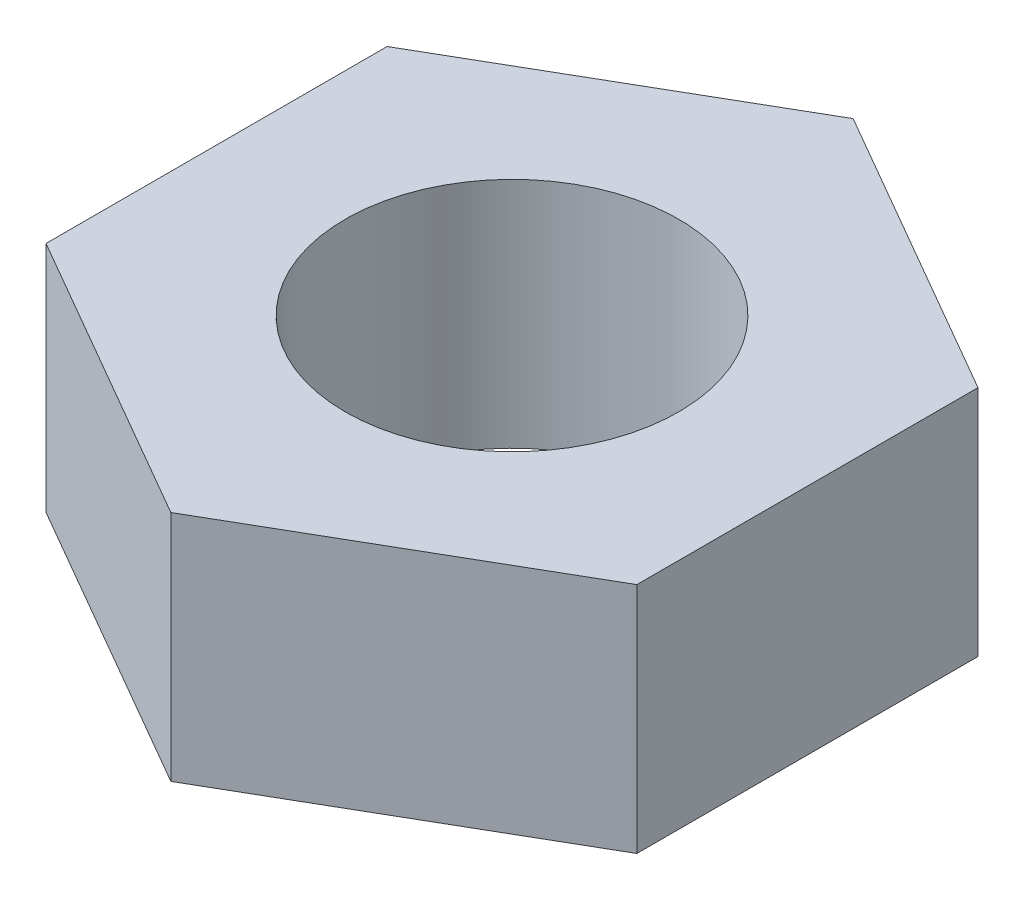
ISO-10303-21;
HEADER;
FILE_DESCRIPTION(('STEP AP214'),'2;1');
FILE_NAME('part.step','',(''),(''),'','','');
FILE_SCHEMA(('AUTOMOTIVE_DESIGN { 1 0 10303 214 1 1 1 1 }'));
ENDSEC;
DATA;
#1=APPLICATION_CONTEXT('core data for automotive mechanical design processes');
#2=APPLICATION_PROTOCOL_DEFINITION('international standard','automotive_design',2000,#1);
#3=PRODUCT_CONTEXT('',#1,'mechanical');
#4=PRODUCT('Part','Part','',(#3));
#5=PRODUCT_RELATED_PRODUCT_CATEGORY('part','',(#4));
#6=PRODUCT_DEFINITION_FORMATION('','',#4);
#7=PRODUCT_DEFINITION_CONTEXT('part definition',#1,'design');
#8=PRODUCT_DEFINITION('design','',#6,#7);
#9=PRODUCT_DEFINITION_SHAPE('','',#8);
#10=(LENGTH_UNIT() NAMED_UNIT(*) SI_UNIT(.MILLI.,.METRE.));
#11=(NAMED_UNIT(*) PLANE_ANGLE_UNIT() SI_UNIT($,.RADIAN.));
#12=(NAMED_UNIT(*) SI_UNIT($,.STERADIAN.) SOLID_ANGLE_UNIT());
#13=UNCERTAINTY_MEASURE_WITH_UNIT(LENGTH_MEASURE(1.E-05),#10,'distance_accuracy_value','');
#14=(GEOMETRIC_REPRESENTATION_CONTEXT(3) GLOBAL_UNCERTAINTY_ASSIGNED_CONTEXT((#13)) GLOBAL_UNIT_ASSIGNED_CONTEXT((#10,
#11,#12)) REPRESENTATION_CONTEXT('',''));
#15=CARTESIAN_POINT('',(0.,0.,0.));
#16=DIRECTION('',(0.,0.,1.));
#17=DIRECTION('',(1.,0.,0.));
#18=AXIS2_PLACEMENT_3D('',#15,#16,#17);
#19=CARTESIAN_POINT('',(4.25,3.35,-2.45373864405591));
#20=DIRECTION('',(-0.5,0.,0.866025403784439));
#21=DIRECTION('',(0.866025403784439,0.,0.5));
#22=AXIS2_PLACEMENT_3D('',#19,#20,#21);
#23=PLANE('',#22);
#24=DIRECTION('',(-0.866025403784439,0.,-0.5));
#25=VECTOR('',#24,1.);
#26=CARTESIAN_POINT('',(4.25,0.,-2.45373864405591));
#27=LINE('',#26,#25);
#28=CARTESIAN_POINT('',(4.25,0.,-2.45373864405591));
#29=VERTEX_POINT('',#28);
#30=CARTESIAN_POINT('',(0.,0.,-4.90747728811182));
#31=VERTEX_POINT('',#30);
#32=EDGE_CURVE('E117',#29,#31,#27,.T.);
#33=ORIENTED_EDGE('',*,*,#32,.T.);
#34=DIRECTION('',(0.,-1.,0.));
#35=VECTOR('',#34,1.);
#36=CARTESIAN_POINT('',(0.,3.35,-4.90747728811182));
#37=LINE('',#36,#35);
#38=CARTESIAN_POINT('',(0.,3.35,-4.90747728811182));
#39=VERTEX_POINT('',#38);
#40=EDGE_CURVE('E11',#39,#31,#37,.T.);
#41=ORIENTED_EDGE('',*,*,#40,.F.);
#42=DIRECTION('',(-0.866025403784439,0.,-0.5));
#43=VECTOR('',#42,1.);
#44=CARTESIAN_POINT('',(4.25,3.35,-2.45373864405591));
#45=LINE('',#44,#43);
#46=CARTESIAN_POINT('',(4.25,3.35,-2.45373864405591));
#47=VERTEX_POINT('',#46);
#48=EDGE_CURVE('E128',#47,#39,#45,.T.);
#49=ORIENTED_EDGE('',*,*,#48,.F.);
#50=DIRECTION('',(0.,-1.,0.));
#51=VECTOR('',#50,1.);
#52=CARTESIAN_POINT('',(4.25,3.35,-2.45373864405591));
#53=LINE('',#52,#51);
#54=EDGE_CURVE('E113',#47,#29,#53,.T.);
#55=ORIENTED_EDGE('',*,*,#54,.T.);
#56=EDGE_LOOP('',(#33,#41,#49,#55));
#57=FACE_BOUND('',#56,.T.);
#58=ADVANCED_FACE('F33',(#57),#23,.F.);
#59=CARTESIAN_POINT('',(0.,3.35,-4.90747728811182));
#60=DIRECTION('',(0.5,0.,0.866025403784439));
#61=DIRECTION('',(0.866025403784439,0.,-0.5));
#62=AXIS2_PLACEMENT_3D('',#59,#60,#61);
#63=PLANE('',#62);
#64=DIRECTION('',(-0.866025403784439,0.,0.5));
#65=VECTOR('',#64,1.);
#66=CARTESIAN_POINT('',(0.,0.,-4.90747728811182));
#67=LINE('',#66,#65);
#68=CARTESIAN_POINT('',(-4.25,0.,-2.45373864405591));
#69=VERTEX_POINT('',#68);
#70=EDGE_CURVE('E120',#31,#69,#67,.T.);
#71=ORIENTED_EDGE('',*,*,#70,.T.);
#72=DIRECTION('',(0.,-1.,0.));
#73=VECTOR('',#72,1.);
#74=CARTESIAN_POINT('',(-4.25,3.35,-2.45373864405591));
#75=LINE('',#74,#73);
#76=CARTESIAN_POINT('',(-4.25,3.35,-2.45373864405591));
#77=VERTEX_POINT('',#76);
#78=EDGE_CURVE('E41',#77,#69,#75,.T.);
#79=ORIENTED_EDGE('',*,*,#78,.F.);
#80=DIRECTION('',(-0.866025403784439,0.,0.5));
#81=VECTOR('',#80,1.);
#82=CARTESIAN_POINT('',(0.,3.35,-4.90747728811182));
#83=LINE('',#82,#81);
#84=EDGE_CURVE('E86',#39,#77,#83,.T.);
#85=ORIENTED_EDGE('',*,*,#84,.F.);
#86=ORIENTED_EDGE('',*,*,#40,.T.);
#87=EDGE_LOOP('',(#71,#79,#85,#86));
#88=FACE_BOUND('',#87,.T.);
#89=ADVANCED_FACE('F153',(#88),#63,.F.);
#90=CARTESIAN_POINT('',(-4.25,3.35,-2.45373864405591));
#91=DIRECTION('',(1.,0.,0.));
#92=DIRECTION('',(0.,0.,-1.));
#93=AXIS2_PLACEMENT_3D('',#90,#91,#92);
#94=PLANE('',#93);
#95=DIRECTION('',(0.,0.,1.));
#96=VECTOR('',#95,1.);
#97=CARTESIAN_POINT('',(-4.25,0.,-2.45373864405591));
#98=LINE('',#97,#96);
#99=CARTESIAN_POINT('',(-4.25,0.,2.45373864405591));
#100=VERTEX_POINT('',#99);
#101=EDGE_CURVE('E123',#69,#100,#98,.T.);
#102=ORIENTED_EDGE('',*,*,#101,.T.);
#103=DIRECTION('',(0.,-1.,0.));
#104=VECTOR('',#103,1.);
#105=CARTESIAN_POINT('',(-4.25,3.35,2.45373864405591));
#106=LINE('',#105,#104);
#107=CARTESIAN_POINT('',(-4.25,3.35,2.45373864405591));
#108=VERTEX_POINT('',#107);
#109=EDGE_CURVE('E108',#108,#100,#106,.T.);
#110=ORIENTED_EDGE('',*,*,#109,.F.);
#111=DIRECTION('',(0.,0.,1.));
#112=VECTOR('',#111,1.);
#113=CARTESIAN_POINT('',(-4.25,3.35,-2.45373864405591));
#114=LINE('',#113,#112);
#115=EDGE_CURVE('E99',#77,#108,#114,.T.);
#116=ORIENTED_EDGE('',*,*,#115,.F.);
#117=ORIENTED_EDGE('',*,*,#78,.T.);
#118=EDGE_LOOP('',(#102,#110,#116,#117));
#119=FACE_BOUND('',#118,.T.);
#120=ADVANCED_FACE('F134',(#119),#94,.F.);
#121=CARTESIAN_POINT('',(-4.25,3.35,2.45373864405591));
#122=DIRECTION('',(0.5,0.,-0.866025403784439));
#123=DIRECTION('',(-0.866025403784438,0.,-0.5));
#124=AXIS2_PLACEMENT_3D('',#121,#122,#123);
#125=PLANE('',#124);
#126=DIRECTION('',(0.866025403784439,0.,0.5));
#127=VECTOR('',#126,1.);
#128=CARTESIAN_POINT('',(-4.25,0.,2.45373864405591));
#129=LINE('',#128,#127);
#130=CARTESIAN_POINT('',(0.,0.,4.90747728811182));
#131=VERTEX_POINT('',#130);
#132=EDGE_CURVE('E107',#100,#131,#129,.T.);
#133=ORIENTED_EDGE('',*,*,#132,.T.);
#134=DIRECTION('',(0.,-1.,0.));
#135=VECTOR('',#134,1.);
#136=CARTESIAN_POINT('',(0.,3.35,4.90747728811182));
#137=LINE('',#136,#135);
#138=CARTESIAN_POINT('',(0.,3.35,4.90747728811182));
#139=VERTEX_POINT('',#138);
#140=EDGE_CURVE('E104',#139,#131,#137,.T.);
#141=ORIENTED_EDGE('',*,*,#140,.F.);
#142=DIRECTION('',(0.866025403784439,0.,0.5));
#143=VECTOR('',#142,1.);
#144=CARTESIAN_POINT('',(-4.25,3.35,2.45373864405591));
#145=LINE('',#144,#143);
#146=EDGE_CURVE('E93',#108,#139,#145,.T.);
#147=ORIENTED_EDGE('',*,*,#146,.F.);
#148=ORIENTED_EDGE('',*,*,#109,.T.);
#149=EDGE_LOOP('',(#133,#141,#147,#148));
#150=FACE_BOUND('',#149,.T.);
#151=ADVANCED_FACE('F105',(#150),#125,.F.);
#152=CARTESIAN_POINT('',(0.,3.35,4.90747728811182));
#153=DIRECTION('',(-0.5,0.,-0.866025403784439));
#154=DIRECTION('',(-0.866025403784439,0.,0.5));
#155=AXIS2_PLACEMENT_3D('',#152,#153,#154);
#156=PLANE('',#155);
#157=DIRECTION('',(0.866025403784439,0.,-0.5));
#158=VECTOR('',#157,1.);
#159=CARTESIAN_POINT('',(0.,0.,4.90747728811182));
#160=LINE('',#159,#158);
#161=CARTESIAN_POINT('',(4.25,0.,2.45373864405591));
#162=VERTEX_POINT('',#161);
#163=EDGE_CURVE('E72',#131,#162,#160,.T.);
#164=ORIENTED_EDGE('',*,*,#163,.T.);
#165=DIRECTION('',(0.,-1.,0.));
#166=VECTOR('',#165,1.);
#167=CARTESIAN_POINT('',(4.25,3.35,2.45373864405591));
#168=LINE('',#167,#166);
#169=CARTESIAN_POINT('',(4.25,3.35,2.45373864405591));
#170=VERTEX_POINT('',#169);
#171=EDGE_CURVE('E109',#170,#162,#168,.T.);
#172=ORIENTED_EDGE('',*,*,#171,.F.);
#173=DIRECTION('',(0.866025403784439,0.,-0.5));
#174=VECTOR('',#173,1.);
#175=CARTESIAN_POINT('',(0.,3.35,4.90747728811182));
#176=LINE('',#175,#174);
#177=EDGE_CURVE('E97',#139,#170,#176,.T.);
#178=ORIENTED_EDGE('',*,*,#177,.F.);
#179=ORIENTED_EDGE('',*,*,#140,.T.);
#180=EDGE_LOOP('',(#164,#172,#178,#179));
#181=FACE_BOUND('',#180,.T.);
#182=ADVANCED_FACE('F111',(#181),#156,.F.);
#183=CARTESIAN_POINT('',(4.25,3.35,2.45373864405591));
#184=DIRECTION('',(-1.,0.,0.));
#185=DIRECTION('',(0.,0.,1.));
#186=AXIS2_PLACEMENT_3D('',#183,#184,#185);
#187=PLANE('',#186);
#188=DIRECTION('',(0.,0.,-1.));
#189=VECTOR('',#188,1.);
#190=CARTESIAN_POINT('',(4.25,0.,2.45373864405591));
#191=LINE('',#190,#189);
#192=EDGE_CURVE('E78',#162,#29,#191,.T.);
#193=ORIENTED_EDGE('',*,*,#192,.T.);
#194=ORIENTED_EDGE('',*,*,#54,.F.);
#195=DIRECTION('',(0.,0.,-1.));
#196=VECTOR('',#195,1.);
#197=CARTESIAN_POINT('',(4.25,3.35,2.45373864405591));
#198=LINE('',#197,#196);
#199=EDGE_CURVE('E49',#170,#47,#198,.T.);
#200=ORIENTED_EDGE('',*,*,#199,.F.);
#201=ORIENTED_EDGE('',*,*,#171,.T.);
#202=EDGE_LOOP('',(#193,#194,#200,#201));
#203=FACE_BOUND('',#202,.T.);
#204=ADVANCED_FACE('F141',(#203),#187,.F.);
#205=CARTESIAN_POINT('',(0.,3.35,0.));
#206=DIRECTION('',(0.,1.,0.));
#207=DIRECTION('',(0.,0.,1.));
#208=AXIS2_PLACEMENT_3D('',#205,#206,#207);
#209=PLANE('',#208);
#210=CARTESIAN_POINT('',(0.,3.35,0.));
#211=DIRECTION('',(0.,1.,0.));
#212=DIRECTION('',(0.,0.,1.));
#213=AXIS2_PLACEMENT_3D('',#210,#211,#212);
#214=CIRCLE('',#213,2.4);
#215=CARTESIAN_POINT('',(0.,3.35,2.4));
#216=VERTEX_POINT('',#215);
#217=EDGE_CURVE('E206',#216,#216,#214,.T.);
#218=ORIENTED_EDGE('',*,*,#217,.F.);
#219=EDGE_LOOP('',(#218));
#220=FACE_BOUND('',#219,.T.);
#221=ORIENTED_EDGE('',*,*,#48,.T.);
#222=ORIENTED_EDGE('',*,*,#84,.T.);
#223=ORIENTED_EDGE('',*,*,#115,.T.);
#224=ORIENTED_EDGE('',*,*,#146,.T.);
#225=ORIENTED_EDGE('',*,*,#177,.T.);
#226=ORIENTED_EDGE('',*,*,#199,.T.);
#227=EDGE_LOOP('',(#221,#222,#223,#224,#225,#226));
#228=FACE_BOUND('',#227,.T.);
#229=ADVANCED_FACE('F95',(#220,#228),#209,.T.);
#230=CARTESIAN_POINT('',(0.,0.,0.));
#231=DIRECTION('',(0.,1.,0.));
#232=DIRECTION('',(0.,0.,1.));
#233=AXIS2_PLACEMENT_3D('',#230,#231,#232);
#234=PLANE('',#233);
#235=CARTESIAN_POINT('',(0.,0.,0.));
#236=DIRECTION('',(0.,1.,0.));
#237=DIRECTION('',(0.,0.,1.));
#238=AXIS2_PLACEMENT_3D('',#235,#236,#237);
#239=CIRCLE('',#238,2.4);
#240=CARTESIAN_POINT('',(0.,0.,2.4));
#241=VERTEX_POINT('',#240);
#242=EDGE_CURVE('E121',#241,#241,#239,.F.);
#243=ORIENTED_EDGE('',*,*,#242,.F.);
#244=EDGE_LOOP('',(#243));
#245=FACE_BOUND('',#244,.T.);
#246=ORIENTED_EDGE('',*,*,#32,.F.);
#247=ORIENTED_EDGE('',*,*,#192,.F.);
#248=ORIENTED_EDGE('',*,*,#163,.F.);
#249=ORIENTED_EDGE('',*,*,#132,.F.);
#250=ORIENTED_EDGE('',*,*,#101,.F.);
#251=ORIENTED_EDGE('',*,*,#70,.F.);
#252=EDGE_LOOP('',(#246,#247,#248,#249,#250,#251));
#253=FACE_BOUND('',#252,.T.);
#254=ADVANCED_FACE('F137',(#245,#253),#234,.F.);
#255=CARTESIAN_POINT('',(0.,-0.00100000000000013,0.));
#256=DIRECTION('',(0.,1.,0.));
#257=DIRECTION('',(0.,0.,1.));
#258=AXIS2_PLACEMENT_3D('',#255,#256,#257);
#259=CYLINDRICAL_SURFACE('',#258,2.4);
#260=ORIENTED_EDGE('',*,*,#217,.T.);
#261=EDGE_LOOP('',(#260));
#262=FACE_BOUND('',#261,.T.);
#263=ORIENTED_EDGE('',*,*,#242,.T.);
#264=EDGE_LOOP('',(#263));
#265=FACE_BOUND('',#264,.T.);
#266=ADVANCED_FACE('F190',(#262,#265),#259,.F.);
#267=CLOSED_SHELL('',(#58,#89,#120,#151,#182,#204,#229,#254,#266));
#268=MANIFOLD_SOLID_BREP('B2',#267);
#269=ADVANCED_BREP_SHAPE_REPRESENTATION('',(#18,#268),#14);
#270=SHAPE_DEFINITION_REPRESENTATION(#9,#269);
ENDSEC;
END-ISO-10303-21;
